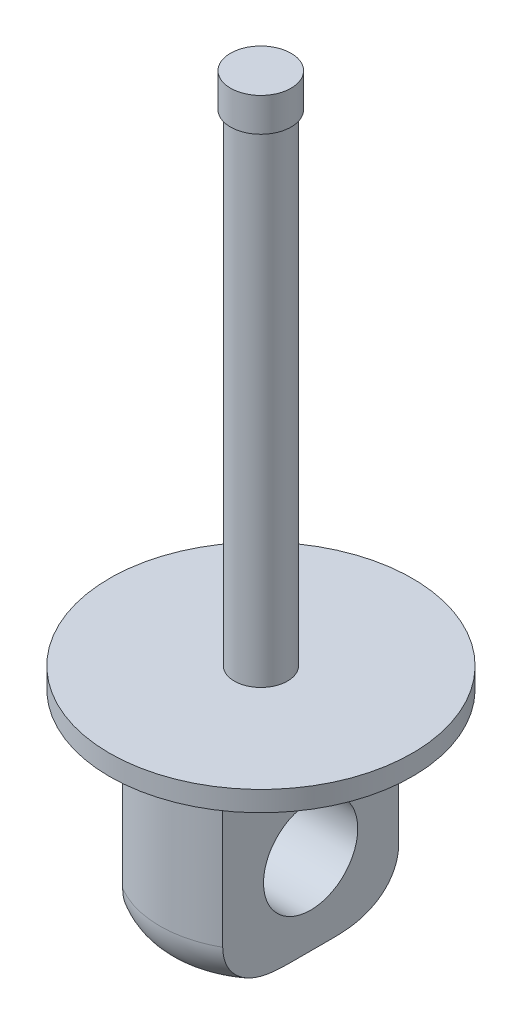
ISO-10303-21;
HEADER;
FILE_DESCRIPTION(('STEP AP214'),'2;1');
FILE_NAME('part.step','',(''),(''),'','','');
FILE_SCHEMA(('AUTOMOTIVE_DESIGN { 1 0 10303 214 1 1 1 1 }'));
ENDSEC;
DATA;
#1=APPLICATION_CONTEXT('core data for automotive mechanical design processes');
#2=APPLICATION_PROTOCOL_DEFINITION('international standard','automotive_design',2000,#1);
#3=PRODUCT_CONTEXT('',#1,'mechanical');
#4=PRODUCT('Part','Part','',(#3));
#5=PRODUCT_RELATED_PRODUCT_CATEGORY('part','',(#4));
#6=PRODUCT_DEFINITION_FORMATION('','',#4);
#7=PRODUCT_DEFINITION_CONTEXT('part definition',#1,'design');
#8=PRODUCT_DEFINITION('design','',#6,#7);
#9=PRODUCT_DEFINITION_SHAPE('','',#8);
#10=(LENGTH_UNIT() NAMED_UNIT(*) SI_UNIT(.MILLI.,.METRE.));
#11=(NAMED_UNIT(*) PLANE_ANGLE_UNIT() SI_UNIT($,.RADIAN.));
#12=(NAMED_UNIT(*) SI_UNIT($,.STERADIAN.) SOLID_ANGLE_UNIT());
#13=UNCERTAINTY_MEASURE_WITH_UNIT(LENGTH_MEASURE(1.E-05),#10,'distance_accuracy_value','');
#14=(GEOMETRIC_REPRESENTATION_CONTEXT(3) GLOBAL_UNCERTAINTY_ASSIGNED_CONTEXT((#13)) GLOBAL_UNIT_ASSIGNED_CONTEXT((#10,
#11,#12)) REPRESENTATION_CONTEXT('',''));
#15=CARTESIAN_POINT('',(0.,0.,0.));
#16=DIRECTION('',(0.,0.,1.));
#17=DIRECTION('',(1.,0.,0.));
#18=AXIS2_PLACEMENT_3D('',#15,#16,#17);
#19=CARTESIAN_POINT('',(0.,7.79999999999998,0.));
#20=DIRECTION('',(0.,-1.,0.));
#21=DIRECTION('',(0.,0.,-1.));
#22=AXIS2_PLACEMENT_3D('',#19,#20,#21);
#23=CYLINDRICAL_SURFACE('',#22,0.395);
#24=CARTESIAN_POINT('',(0.,0.299999999999985,0.));
#25=DIRECTION('',(0.,1.,0.));
#26=DIRECTION('',(0.,0.,1.));
#27=AXIS2_PLACEMENT_3D('',#24,#25,#26);
#28=CIRCLE('',#27,0.395);
#29=CARTESIAN_POINT('',(0.,0.299999999999985,0.394999999999998));
#30=VERTEX_POINT('',#29);
#31=EDGE_CURVE('E235',#30,#30,#28,.T.);
#32=ORIENTED_EDGE('',*,*,#31,.T.);
#33=EDGE_LOOP('',(#32));
#34=FACE_BOUND('',#33,.T.);
#35=CARTESIAN_POINT('',(0.,7.45523603554175,0.));
#36=DIRECTION('',(0.,1.,0.));
#37=DIRECTION('',(0.,0.,1.));
#38=AXIS2_PLACEMENT_3D('',#35,#36,#37);
#39=CIRCLE('',#38,0.395);
#40=CARTESIAN_POINT('',(0.,7.45523603554175,0.394999999999998));
#41=VERTEX_POINT('',#40);
#42=EDGE_CURVE('E11',#41,#41,#39,.T.);
#43=ORIENTED_EDGE('',*,*,#42,.F.);
#44=EDGE_LOOP('',(#43));
#45=FACE_BOUND('',#44,.T.);
#46=ADVANCED_FACE('F37',(#34,#45),#23,.T.);
#47=CARTESIAN_POINT('',(0.,0.299999999999985,0.));
#48=DIRECTION('',(0.,-1.,0.));
#49=DIRECTION('',(0.,0.,-1.));
#50=AXIS2_PLACEMENT_3D('',#47,#48,#49);
#51=CYLINDRICAL_SURFACE('',#50,2.25);
#52=CARTESIAN_POINT('',(0.,0.299999999999985,0.));
#53=DIRECTION('',(0.,1.,0.));
#54=DIRECTION('',(0.,0.,1.));
#55=AXIS2_PLACEMENT_3D('',#52,#53,#54);
#56=CIRCLE('',#55,2.25);
#57=CARTESIAN_POINT('',(0.,0.299999999999985,2.25));
#58=VERTEX_POINT('',#57);
#59=EDGE_CURVE('E238',#58,#58,#56,.T.);
#60=ORIENTED_EDGE('',*,*,#59,.F.);
#61=EDGE_LOOP('',(#60));
#62=FACE_BOUND('',#61,.T.);
#63=CARTESIAN_POINT('',(0.,0.,0.));
#64=DIRECTION('',(0.,1.,0.));
#65=DIRECTION('',(0.,0.,1.));
#66=AXIS2_PLACEMENT_3D('',#63,#64,#65);
#67=CIRCLE('',#66,2.25);
#68=CARTESIAN_POINT('',(0.,0.,2.25));
#69=VERTEX_POINT('',#68);
#70=EDGE_CURVE('E234',#69,#69,#67,.T.);
#71=ORIENTED_EDGE('',*,*,#70,.T.);
#72=EDGE_LOOP('',(#71));
#73=FACE_BOUND('',#72,.T.);
#74=ADVANCED_FACE('F160',(#62,#73),#51,.T.);
#75=CARTESIAN_POINT('',(0.,0.299999999999985,0.));
#76=DIRECTION('',(0.,1.,0.));
#77=DIRECTION('',(0.,0.,1.));
#78=AXIS2_PLACEMENT_3D('',#75,#76,#77);
#79=PLANE('',#78);
#80=ORIENTED_EDGE('',*,*,#31,.F.);
#81=EDGE_LOOP('',(#80));
#82=FACE_BOUND('',#81,.T.);
#83=ORIENTED_EDGE('',*,*,#59,.T.);
#84=EDGE_LOOP('',(#83));
#85=FACE_BOUND('',#84,.T.);
#86=ADVANCED_FACE('F162',(#82,#85),#79,.T.);
#87=CARTESIAN_POINT('',(0.,0.,0.));
#88=DIRECTION('',(0.,1.,0.));
#89=DIRECTION('',(0.,0.,1.));
#90=AXIS2_PLACEMENT_3D('',#87,#88,#89);
#91=PLANE('',#90);
#92=CARTESIAN_POINT('',(0.,0.,0.));
#93=DIRECTION('',(0.,1.,0.));
#94=DIRECTION('',(0.,0.,1.));
#95=AXIS2_PLACEMENT_3D('',#92,#93,#94);
#96=CIRCLE('',#95,1.5);
#97=CARTESIAN_POINT('',(0.,0.,1.5));
#98=VERTEX_POINT('',#97);
#99=EDGE_CURVE('E231',#98,#98,#96,.T.);
#100=ORIENTED_EDGE('',*,*,#99,.T.);
#101=EDGE_LOOP('',(#100));
#102=FACE_BOUND('',#101,.T.);
#103=ORIENTED_EDGE('',*,*,#70,.F.);
#104=EDGE_LOOP('',(#103));
#105=FACE_BOUND('',#104,.T.);
#106=ADVANCED_FACE('F157',(#102,#105),#91,.F.);
#107=CARTESIAN_POINT('',(0.,-3.00000000000002,0.));
#108=DIRECTION('',(0.,1.,0.));
#109=DIRECTION('',(0.,0.,1.));
#110=AXIS2_PLACEMENT_3D('',#107,#108,#109);
#111=CYLINDRICAL_SURFACE('',#110,1.5);
#112=DIRECTION('',(0.,1.,0.));
#113=VECTOR('',#112,1.);
#114=CARTESIAN_POINT('',(-0.761930785817048,-3.00000000000002,1.29207642096906));
#115=LINE('',#114,#113);
#116=CARTESIAN_POINT('',(-0.761930785817048,-2.30000000000002,1.29207642096906));
#117=VERTEX_POINT('',#116);
#118=CARTESIAN_POINT('',(-0.761930785817048,-0.391885250498285,1.29207642096906));
#119=VERTEX_POINT('',#118);
#120=EDGE_CURVE('E227',#117,#119,#115,.T.);
#121=ORIENTED_EDGE('',*,*,#120,.F.);
#122=CARTESIAN_POINT('',(0.,-2.30000000000002,0.));
#123=DIRECTION('',(0.,1.,0.));
#124=DIRECTION('',(0.,0.,1.));
#125=AXIS2_PLACEMENT_3D('',#122,#123,#124);
#126=CIRCLE('',#125,1.5);
#127=CARTESIAN_POINT('',(0.738069214182952,-2.30000000000002,1.30585368057656));
#128=VERTEX_POINT('',#127);
#129=EDGE_CURVE('E131',#117,#128,#126,.T.);
#130=ORIENTED_EDGE('',*,*,#129,.T.);
#131=DIRECTION('',(0.,1.,0.));
#132=VECTOR('',#131,1.);
#133=CARTESIAN_POINT('',(0.738069214182952,-3.00000000000002,1.30585368057656));
#134=LINE('',#133,#132);
#135=CARTESIAN_POINT('',(0.738069214182952,-0.337717237195698,1.30585368057656));
#136=VERTEX_POINT('',#135);
#137=EDGE_CURVE('E105',#136,#128,#134,.F.);
#138=ORIENTED_EDGE('',*,*,#137,.F.);
#139=CARTESIAN_POINT('',(0.,-0.337717237195698,0.));
#140=DIRECTION('',(0.,1.,0.));
#141=DIRECTION('',(-1.,0.,0.));
#142=AXIS2_PLACEMENT_3D('',#139,#140,#141);
#143=CIRCLE('',#142,1.5);
#144=CARTESIAN_POINT('',(0.738069214182952,-0.337717237195698,-1.30585368057656));
#145=VERTEX_POINT('',#144);
#146=EDGE_CURVE('E110',#145,#136,#143,.F.);
#147=ORIENTED_EDGE('',*,*,#146,.F.);
#148=DIRECTION('',(0.,1.,0.));
#149=VECTOR('',#148,1.);
#150=CARTESIAN_POINT('',(0.738069214182952,-3.00000000000002,-1.30585368057656));
#151=LINE('',#150,#149);
#152=CARTESIAN_POINT('',(0.738069214182952,-2.30000000000002,-1.30585368057656));
#153=VERTEX_POINT('',#152);
#154=EDGE_CURVE('E92',#153,#145,#151,.T.);
#155=ORIENTED_EDGE('',*,*,#154,.F.);
#156=CARTESIAN_POINT('',(0.,-2.30000000000002,0.));
#157=DIRECTION('',(0.,1.,0.));
#158=DIRECTION('',(0.,0.,1.));
#159=AXIS2_PLACEMENT_3D('',#156,#157,#158);
#160=CIRCLE('',#159,1.5);
#161=CARTESIAN_POINT('',(-0.761930785817048,-2.30000000000002,-1.29207642096907));
#162=VERTEX_POINT('',#161);
#163=EDGE_CURVE('E120',#153,#162,#160,.T.);
#164=ORIENTED_EDGE('',*,*,#163,.T.);
#165=DIRECTION('',(0.,1.,0.));
#166=VECTOR('',#165,1.);
#167=CARTESIAN_POINT('',(-0.761930785817048,-3.00000000000002,-1.29207642096907));
#168=LINE('',#167,#166);
#169=CARTESIAN_POINT('',(-0.761930785817048,-0.391885250498285,-1.29207642096907));
#170=VERTEX_POINT('',#169);
#171=EDGE_CURVE('E229',#170,#162,#168,.F.);
#172=ORIENTED_EDGE('',*,*,#171,.F.);
#173=CARTESIAN_POINT('',(0.,-0.391885250498285,0.));
#174=DIRECTION('',(0.,1.,0.));
#175=DIRECTION('',(0.,0.,1.));
#176=AXIS2_PLACEMENT_3D('',#173,#174,#175);
#177=CIRCLE('',#176,1.5);
#178=EDGE_CURVE('E117',#119,#170,#177,.F.);
#179=ORIENTED_EDGE('',*,*,#178,.F.);
#180=EDGE_LOOP('',(#121,#130,#138,#147,#155,#164,#172,#179));
#181=FACE_BOUND('',#180,.T.);
#182=ORIENTED_EDGE('',*,*,#99,.F.);
#183=EDGE_LOOP('',(#182));
#184=FACE_BOUND('',#183,.T.);
#185=ADVANCED_FACE('F114',(#181,#184),#111,.T.);
#186=CARTESIAN_POINT('',(0.,-3.00000000000002,0.));
#187=DIRECTION('',(0.,1.,0.));
#188=DIRECTION('',(0.,0.,1.));
#189=AXIS2_PLACEMENT_3D('',#186,#187,#188);
#190=PLANE('',#189);
#191=DIRECTION('',(0.,0.,1.));
#192=VECTOR('',#191,1.);
#193=CARTESIAN_POINT('',(0.738069214182952,-3.00000000000002,0.));
#194=LINE('',#193,#192);
#195=CARTESIAN_POINT('',(0.738069214182952,-3.00000000000002,-0.308632200321602));
#196=VERTEX_POINT('',#195);
#197=CARTESIAN_POINT('',(0.738069214182952,-3.00000000000002,0.308632200321599));
#198=VERTEX_POINT('',#197);
#199=EDGE_CURVE('E122',#196,#198,#194,.T.);
#200=ORIENTED_EDGE('',*,*,#199,.T.);
#201=CARTESIAN_POINT('',(0.,-3.00000000000002,0.));
#202=DIRECTION('',(0.,1.,0.));
#203=DIRECTION('',(0.,0.,1.));
#204=AXIS2_PLACEMENT_3D('',#201,#202,#203);
#205=CIRCLE('',#204,0.8);
#206=CARTESIAN_POINT('',(-0.761930785817048,-3.00000000000002,0.243847242396183));
#207=VERTEX_POINT('',#206);
#208=EDGE_CURVE('E60',#198,#207,#205,.F.);
#209=ORIENTED_EDGE('',*,*,#208,.T.);
#210=DIRECTION('',(0.,0.,-1.));
#211=VECTOR('',#210,1.);
#212=CARTESIAN_POINT('',(-0.761930785817048,-3.00000000000002,0.));
#213=LINE('',#212,#211);
#214=CARTESIAN_POINT('',(-0.761930785817048,-3.00000000000002,-0.243847242396187));
#215=VERTEX_POINT('',#214);
#216=EDGE_CURVE('E118',#207,#215,#213,.T.);
#217=ORIENTED_EDGE('',*,*,#216,.T.);
#218=CARTESIAN_POINT('',(0.,-3.00000000000002,0.));
#219=DIRECTION('',(0.,1.,0.));
#220=DIRECTION('',(0.,0.,1.));
#221=AXIS2_PLACEMENT_3D('',#218,#219,#220);
#222=CIRCLE('',#221,0.8);
#223=EDGE_CURVE('E243',#215,#196,#222,.F.);
#224=ORIENTED_EDGE('',*,*,#223,.T.);
#225=EDGE_LOOP('',(#200,#209,#217,#224));
#226=FACE_BOUND('',#225,.T.);
#227=ADVANCED_FACE('F149',(#226),#190,.F.);
#228=CARTESIAN_POINT('',(0.738069214182952,-0.337717237195697,-2.25));
#229=DIRECTION('',(-1.,0.,0.));
#230=DIRECTION('',(0.,-1.,0.));
#231=AXIS2_PLACEMENT_3D('',#228,#229,#230);
#232=PLANE('',#231);
#233=CARTESIAN_POINT('',(0.738069214182951,-1.77508589403887,0.));
#234=DIRECTION('',(-1.,0.,0.));
#235=DIRECTION('',(0.,-1.,0.));
#236=AXIS2_PLACEMENT_3D('',#233,#234,#235);
#237=CIRCLE('',#236,0.7);
#238=CARTESIAN_POINT('',(0.738069214182952,-2.47508589403887,0.));
#239=VERTEX_POINT('',#238);
#240=EDGE_CURVE('E111',#239,#239,#237,.T.);
#241=ORIENTED_EDGE('',*,*,#240,.T.);
#242=EDGE_LOOP('',(#241));
#243=FACE_BOUND('',#242,.T.);
#244=ORIENTED_EDGE('',*,*,#137,.T.);
#245=CARTESIAN_POINT('',(0.738069214182952,-2.30000000000002,1.30585368057656));
#246=CARTESIAN_POINT('',(0.738069214182952,-2.33514936249104,1.30589639599615));
#247=CARTESIAN_POINT('',(0.738069214182952,-2.37027398010588,1.30281581745067));
#248=CARTESIAN_POINT('',(0.738069214182952,-2.43939214284064,1.29073982754498));
#249=CARTESIAN_POINT('',(0.738069214182952,-2.4733886227749,1.28176127654391));
#250=CARTESIAN_POINT('',(0.738069214182952,-2.53937355934971,1.25822008014012));
#251=CARTESIAN_POINT('',(0.738069214182952,-2.57136241748152,1.24365855540761));
#252=CARTESIAN_POINT('',(0.738069214182952,-2.63253774540124,1.20952136100962));
#253=CARTESIAN_POINT('',(0.738069214182952,-2.66172351432882,1.18994444180217));
#254=CARTESIAN_POINT('',(0.738069214182952,-2.71747136892118,1.14583528929524));
#255=CARTESIAN_POINT('',(0.738069214182952,-2.7439313995554,1.12117456171779));
#256=CARTESIAN_POINT('',(0.738069214182952,-2.79279324256156,1.06812185657601));
#257=CARTESIAN_POINT('',(0.738069214182952,-2.81519314906108,1.03972813743337));
#258=CARTESIAN_POINT('',(0.738069214182952,-2.85781818673537,0.977023409354084));
#259=CARTESIAN_POINT('',(0.738069214182952,-2.87758767695568,0.942404231303248));
#260=CARTESIAN_POINT('',(0.738069214182952,-2.91205497956265,0.870768746384556));
#261=CARTESIAN_POINT('',(0.738069214182952,-2.92675348665464,0.83375276869497));
#262=CARTESIAN_POINT('',(0.738069214182952,-2.94977131566675,0.763491073909761));
#263=CARTESIAN_POINT('',(0.738069214182952,-2.95869380202504,0.730437751935441));
#264=CARTESIAN_POINT('',(0.738069214182952,-2.97351069064061,0.663649160630822));
#265=CARTESIAN_POINT('',(0.738069214182952,-2.97940293711302,0.629913423498718));
#266=CARTESIAN_POINT('',(0.738069214182952,-2.99330831731454,0.528030697000638));
#267=CARTESIAN_POINT('',(0.738069214182952,-2.99750024211216,0.459379092758363));
#268=CARTESIAN_POINT('',(0.738069214182952,-2.99944070236192,0.377072784063177));
#269=CARTESIAN_POINT('',(0.738069214182952,-2.99966111615829,0.363357848894137));
#270=CARTESIAN_POINT('',(0.738069214182952,-2.99994001815315,0.335974075023673));
#271=CARTESIAN_POINT('',(0.738069214182952,-2.99999906843122,0.322305242384728));
#272=CARTESIAN_POINT('',(0.738069214182952,-3.00000000000002,0.308632200321599));
#273=B_SPLINE_CURVE_WITH_KNOTS('',3,(#245,#246,#247,#248,#249,#250,#251,#252,#253,#254,#255,
#256,#257,#258,#259,#260,#261,#262,#263,#264,#265,#266,#267,#268,#269,#270,#271,#272),
.UNSPECIFIED.,.F.,.F.,(4,2,2,2,2,2,2,2,2,2,2,2,2,4),(0.,0.105275008144074,0.210250371794249,
0.315204674764178,0.420185151659421,0.528244593952581,0.636354630054923,0.755504151857335,
0.874637344142315,0.977187740752182,1.07981099358269,1.28558522667068,1.32673908880032,
1.36774941532148),.UNSPECIFIED.);
#274=EDGE_CURVE('E139',#128,#198,#273,.T.);
#275=ORIENTED_EDGE('',*,*,#274,.T.);
#276=ORIENTED_EDGE('',*,*,#199,.F.);
#277=CARTESIAN_POINT('',(0.738069214182952,-3.00000000000002,-0.308632200321602));
#278=CARTESIAN_POINT('',(0.738069214182952,-3.00000440720581,-0.347176675629199));
#279=CARTESIAN_POINT('',(0.738069214182952,-2.99952910830386,-0.385766934860777));
#280=CARTESIAN_POINT('',(0.738069214182952,-2.99669144309631,-0.463084338331316));
#281=CARTESIAN_POINT('',(0.738069214182952,-2.99431864999903,-0.501811058518774));
#282=CARTESIAN_POINT('',(0.738069214182952,-2.98667644802667,-0.57964116921868));
#283=CARTESIAN_POINT('',(0.738069214182952,-2.98136078183866,-0.618740512398707));
#284=CARTESIAN_POINT('',(0.738069214182952,-2.96696355029386,-0.696166527060839));
#285=CARTESIAN_POINT('',(0.738069214182952,-2.95789095085323,-0.73449481184266));
#286=CARTESIAN_POINT('',(0.738069214182952,-2.93389565596056,-0.814516974091887));
#287=CARTESIAN_POINT('',(0.738069214182952,-2.91838876241128,-0.856041759529606));
#288=CARTESIAN_POINT('',(0.738069214182952,-2.88121900914098,-0.936051115442285));
#289=CARTESIAN_POINT('',(0.738069214182952,-2.85958555148339,-0.974549110808588));
#290=CARTESIAN_POINT('',(0.738069214182952,-2.80972405194261,-1.04764313924205));
#291=CARTESIAN_POINT('',(0.738069214182952,-2.78143124959128,-1.08219556001074));
#292=CARTESIAN_POINT('',(0.738069214182952,-2.71872506548374,-1.1453438387253));
#293=CARTESIAN_POINT('',(0.738069214182952,-2.68430689826274,-1.17393500121371));
#294=CARTESIAN_POINT('',(0.738069214182952,-2.61444245891296,-1.22083368022724));
#295=CARTESIAN_POINT('',(0.738069214182952,-2.57952115466386,-1.23992430361557));
#296=CARTESIAN_POINT('',(0.738069214182952,-2.50673581296636,-1.27118381810803));
#297=CARTESIAN_POINT('',(0.738069214182952,-2.46887716062336,-1.28336505072652));
#298=CARTESIAN_POINT('',(0.738069214182952,-2.40885220902531,-1.29646183238772));
#299=CARTESIAN_POINT('',(0.738069214182952,-2.3872234863314,-1.29997895851982));
#300=CARTESIAN_POINT('',(0.738069214182952,-2.34373449802698,-1.30467500898899));
#301=CARTESIAN_POINT('',(0.738069214182952,-2.32187446962189,-1.30585613193015));
#302=CARTESIAN_POINT('',(0.738069214182952,-2.30000000000002,-1.30585368057656));
#303=B_SPLINE_CURVE_WITH_KNOTS('',3,(#277,#278,#279,#280,#281,#282,#283,#284,#285,#286,#287,
#288,#289,#290,#291,#292,#293,#294,#295,#296,#297,#298,#299,#300,#301,#302),.UNSPECIFIED.,.F.,
.F.,(4,2,2,2,2,2,2,2,2,2,2,2,4),(0.,0.115702149276045,0.232044490753385,0.350269715429072,
0.468214407106892,0.600728170126638,0.732616459052884,0.865844574837765,0.999177236206101,
1.11791451760311,1.2364390378155,1.30206444289288,1.36762805307296),.UNSPECIFIED.);
#304=EDGE_CURVE('E100',#196,#153,#303,.T.);
#305=ORIENTED_EDGE('',*,*,#304,.T.);
#306=ORIENTED_EDGE('',*,*,#154,.T.);
#307=DIRECTION('',(0.,0.,1.));
#308=VECTOR('',#307,1.);
#309=CARTESIAN_POINT('',(0.738069214182952,-0.337717237195697,-2.25));
#310=LINE('',#309,#308);
#311=EDGE_CURVE('E96',#145,#136,#310,.T.);
#312=ORIENTED_EDGE('',*,*,#311,.T.);
#313=EDGE_LOOP('',(#244,#275,#276,#305,#306,#312));
#314=FACE_BOUND('',#313,.T.);
#315=ADVANCED_FACE('F95',(#243,#314),#232,.F.);
#316=CARTESIAN_POINT('',(0.738069214182952,-0.337717237195697,-2.25));
#317=DIRECTION('',(0.,1.,0.));
#318=DIRECTION('',(-1.,0.,0.));
#319=AXIS2_PLACEMENT_3D('',#316,#317,#318);
#320=PLANE('',#319);
#321=ORIENTED_EDGE('',*,*,#146,.T.);
#322=ORIENTED_EDGE('',*,*,#311,.F.);
#323=EDGE_LOOP('',(#321,#322));
#324=FACE_BOUND('',#323,.T.);
#325=ADVANCED_FACE('F109',(#324),#320,.F.);
#326=CARTESIAN_POINT('',(-0.761930785817048,-0.391885250498285,-2.25));
#327=DIRECTION('',(1.,0.,0.));
#328=DIRECTION('',(0.,1.,0.));
#329=AXIS2_PLACEMENT_3D('',#326,#327,#328);
#330=PLANE('',#329);
#331=CARTESIAN_POINT('',(-0.761930785817048,-1.77508589403887,0.));
#332=DIRECTION('',(1.,0.,0.));
#333=DIRECTION('',(0.,1.,0.));
#334=AXIS2_PLACEMENT_3D('',#331,#332,#333);
#335=CIRCLE('',#334,0.7);
#336=CARTESIAN_POINT('',(-0.761930785817048,-1.07508589403887,0.));
#337=VERTEX_POINT('',#336);
#338=EDGE_CURVE('E126',#337,#337,#335,.T.);
#339=ORIENTED_EDGE('',*,*,#338,.T.);
#340=EDGE_LOOP('',(#339));
#341=FACE_BOUND('',#340,.T.);
#342=ORIENTED_EDGE('',*,*,#216,.F.);
#343=CARTESIAN_POINT('',(-0.761930785817048,-3.00000000000002,0.243847242396183));
#344=CARTESIAN_POINT('',(-0.761930785817048,-2.9999901066109,0.282278378480521));
#345=CARTESIAN_POINT('',(-0.761930785817048,-2.99970941758254,0.320741226546103));
#346=CARTESIAN_POINT('',(-0.761930785817048,-2.99772161945702,0.397804045690636));
#347=CARTESIAN_POINT('',(-0.761930785817048,-2.99600786684282,0.436403820131028));
#348=CARTESIAN_POINT('',(-0.761930785817048,-2.99020086050617,0.514147975387891));
#349=CARTESIAN_POINT('',(-0.761930785817048,-2.98606529362043,0.553289639147654));
#350=CARTESIAN_POINT('',(-0.761930785817048,-2.97449545232456,0.631023039249803));
#351=CARTESIAN_POINT('',(-0.761930785817048,-2.96706768838093,0.669615706562362));
#352=CARTESIAN_POINT('',(-0.761930785817048,-2.94636734343756,0.752974396976507));
#353=CARTESIAN_POINT('',(-0.761930785817048,-2.93226083355331,0.797543430346496));
#354=CARTESIAN_POINT('',(-0.761930785817048,-2.89745067949045,0.883839968651296));
#355=CARTESIAN_POINT('',(-0.761930785817048,-2.87677917196201,0.925580138152756));
#356=CARTESIAN_POINT('',(-0.761930785817048,-2.82810266231927,1.00532786048621));
#357=CARTESIAN_POINT('',(-0.761930785817048,-2.80001008144852,1.04328283537452));
#358=CARTESIAN_POINT('',(-0.761930785817048,-2.73681481646823,1.11295756785722));
#359=CARTESIAN_POINT('',(-0.761930785817048,-2.70170913426657,1.14467464721145));
#360=CARTESIAN_POINT('',(-0.761930785817048,-2.63091168385989,1.19601542840462));
#361=CARTESIAN_POINT('',(-0.761930785817048,-2.59599700903701,1.21671267918096));
#362=CARTESIAN_POINT('',(-0.761930785817048,-2.5228622843665,1.25099821845843));
#363=CARTESIAN_POINT('',(-0.761930785817048,-2.4846482917389,1.26459922459505));
#364=CARTESIAN_POINT('',(-0.761930785817048,-2.42171922322186,1.28018585730272));
#365=CARTESIAN_POINT('',(-0.761930785817048,-2.39758907114116,1.28463498014407));
#366=CARTESIAN_POINT('',(-0.761930785817048,-2.34897846837269,1.2905825477347));
#367=CARTESIAN_POINT('',(-0.761930785817048,-2.32449816692927,1.29208221397798));
#368=CARTESIAN_POINT('',(-0.761930785817048,-2.30000000000002,1.29207642096906));
#369=B_SPLINE_CURVE_WITH_KNOTS('',3,(#343,#344,#345,#346,#347,#348,#349,#350,#351,#352,#353,
#354,#355,#356,#357,#358,#359,#360,#361,#362,#363,#364,#365,#366,#367,#368),.UNSPECIFIED.,.F.,
.F.,(4,2,2,2,2,2,2,2,2,2,2,2,4),(0.,0.115342917257483,0.231223534618572,0.349191872917678,
0.466927957253574,0.606707176554821,0.745812437166055,0.886638970579845,1.0275258364922,
1.14859447408617,1.26944538498066,1.34289057107957,1.41630533402797),.UNSPECIFIED.);
#370=EDGE_CURVE('E46',#207,#117,#369,.T.);
#371=ORIENTED_EDGE('',*,*,#370,.T.);
#372=ORIENTED_EDGE('',*,*,#120,.T.);
#373=DIRECTION('',(0.,0.,1.));
#374=VECTOR('',#373,1.);
#375=CARTESIAN_POINT('',(-0.761930785817048,-0.391885250498285,-2.25));
#376=LINE('',#375,#374);
#377=EDGE_CURVE('E106',#170,#119,#376,.T.);
#378=ORIENTED_EDGE('',*,*,#377,.F.);
#379=ORIENTED_EDGE('',*,*,#171,.T.);
#380=CARTESIAN_POINT('',(-0.761930785817048,-2.30000000000002,-1.29207642096907));
#381=CARTESIAN_POINT('',(-0.761930785817048,-2.33485293431817,-1.29211968588198));
#382=CARTESIAN_POINT('',(-0.761930785817048,-2.36968018261094,-1.2890578179923));
#383=CARTESIAN_POINT('',(-0.761930785817048,-2.43820471727877,-1.27706081340733));
#384=CARTESIAN_POINT('',(-0.761930785817048,-2.47190506964648,-1.26814325726908));
#385=CARTESIAN_POINT('',(-0.761930785817048,-2.53730918476161,-1.24477113152676));
#386=CARTESIAN_POINT('',(-0.761930785817048,-2.56901343373841,-1.23031791647338));
#387=CARTESIAN_POINT('',(-0.761930785817048,-2.62964626141726,-1.19644938630932));
#388=CARTESIAN_POINT('',(-0.761930785817048,-2.65857406112299,-1.17703268414435));
#389=CARTESIAN_POINT('',(-0.761930785817048,-2.71388162333106,-1.13327280523311));
#390=CARTESIAN_POINT('',(-0.761930785817048,-2.74015551162267,-1.10879635337442));
#391=CARTESIAN_POINT('',(-0.761930785817048,-2.78870069163605,-1.05615770991307));
#392=CARTESIAN_POINT('',(-0.761930785817048,-2.81096994282059,-1.02799365187331));
#393=CARTESIAN_POINT('',(-0.761930785817048,-2.85352475771072,-0.965629870704406));
#394=CARTESIAN_POINT('',(-0.761930785817048,-2.87333402238895,-0.931106820814206));
#395=CARTESIAN_POINT('',(-0.761930785817048,-2.90793614326318,-0.859681895406034));
#396=CARTESIAN_POINT('',(-0.761930785817048,-2.9227304578005,-0.82278071516668));
#397=CARTESIAN_POINT('',(-0.761930785817048,-2.94622690928233,-0.752056541248788));
#398=CARTESIAN_POINT('',(-0.761930785817048,-2.95544994407265,-0.718402169060427));
#399=CARTESIAN_POINT('',(-0.761930785817048,-2.97081642089239,-0.650386622456503));
#400=CARTESIAN_POINT('',(-0.761930785817048,-2.9769575618544,-0.616024939801662));
#401=CARTESIAN_POINT('',(-0.761930785817048,-2.99159674744973,-0.512177315428635));
#402=CARTESIAN_POINT('',(-0.761930785817048,-2.99623960499217,-0.442169662019297));
#403=CARTESIAN_POINT('',(-0.761930785817048,-2.9990018222747,-0.350747917492375));
#404=CARTESIAN_POINT('',(-0.761930785817048,-2.99941227779336,-0.329301755027519));
#405=CARTESIAN_POINT('',(-0.761930785817048,-2.99990891583491,-0.286521918921153));
#406=CARTESIAN_POINT('',(-0.761930785817048,-2.99999684979005,-0.265188267833561));
#407=CARTESIAN_POINT('',(-0.761930785817048,-3.00000000000002,-0.243847242396187));
#408=B_SPLINE_CURVE_WITH_KNOTS('',3,(#380,#381,#382,#383,#384,#385,#386,#387,#388,#389,#390,
#391,#392,#393,#394,#395,#396,#397,#398,#399,#400,#401,#402,#403,#404,#405,#406,#407),
.UNSPECIFIED.,.F.,.F.,(4,2,2,2,2,2,2,2,2,2,2,2,2,4),(0.,0.104384697882972,0.208457425313052,
0.312504702870509,0.416581088450059,0.523861887234086,0.63119719632123,0.750161208884687,
0.869090597122672,0.973613043699833,1.07821341531315,1.28815859754632,1.3525157740756,
1.4165229413384),.UNSPECIFIED.);
#409=EDGE_CURVE('E53',#162,#215,#408,.T.);
#410=ORIENTED_EDGE('',*,*,#409,.T.);
#411=EDGE_LOOP('',(#342,#371,#372,#378,#379,#410));
#412=FACE_BOUND('',#411,.T.);
#413=ADVANCED_FACE('F187',(#341,#412),#330,.F.);
#414=CARTESIAN_POINT('',(-0.761930785817048,-0.391885250498285,-2.25));
#415=DIRECTION('',(0.,1.,0.));
#416=DIRECTION('',(0.,0.,1.));
#417=AXIS2_PLACEMENT_3D('',#414,#415,#416);
#418=PLANE('',#417);
#419=ORIENTED_EDGE('',*,*,#178,.T.);
#420=ORIENTED_EDGE('',*,*,#377,.T.);
#421=EDGE_LOOP('',(#419,#420));
#422=FACE_BOUND('',#421,.T.);
#423=ADVANCED_FACE('F191',(#422),#418,.F.);
#424=CARTESIAN_POINT('',(-2.25,-1.77508589403887,0.));
#425=DIRECTION('',(1.,0.,0.));
#426=DIRECTION('',(0.,0.,-1.));
#427=AXIS2_PLACEMENT_3D('',#424,#425,#426);
#428=CYLINDRICAL_SURFACE('',#427,0.7);
#429=ORIENTED_EDGE('',*,*,#338,.F.);
#430=EDGE_LOOP('',(#429));
#431=FACE_BOUND('',#430,.T.);
#432=ORIENTED_EDGE('',*,*,#240,.F.);
#433=EDGE_LOOP('',(#432));
#434=FACE_BOUND('',#433,.T.);
#435=ADVANCED_FACE('F174',(#431,#434),#428,.F.);
#436=CARTESIAN_POINT('',(0.,-2.30000000000002,0.));
#437=DIRECTION('',(0.,1.,0.));
#438=DIRECTION('',(0.,0.,1.));
#439=AXIS2_PLACEMENT_3D('',#436,#437,#438);
#440=TOROIDAL_SURFACE('',#439,0.8,0.7);
#441=ORIENTED_EDGE('',*,*,#370,.F.);
#442=ORIENTED_EDGE('',*,*,#208,.F.);
#443=ORIENTED_EDGE('',*,*,#274,.F.);
#444=ORIENTED_EDGE('',*,*,#129,.F.);
#445=EDGE_LOOP('',(#441,#442,#443,#444));
#446=FACE_BOUND('',#445,.T.);
#447=ADVANCED_FACE('F171',(#446),#440,.T.);
#448=CARTESIAN_POINT('',(0.,-2.30000000000002,0.));
#449=DIRECTION('',(0.,1.,0.));
#450=DIRECTION('',(0.,0.,1.));
#451=AXIS2_PLACEMENT_3D('',#448,#449,#450);
#452=TOROIDAL_SURFACE('',#451,0.8,0.7);
#453=ORIENTED_EDGE('',*,*,#304,.F.);
#454=ORIENTED_EDGE('',*,*,#223,.F.);
#455=ORIENTED_EDGE('',*,*,#409,.F.);
#456=ORIENTED_EDGE('',*,*,#163,.F.);
#457=EDGE_LOOP('',(#453,#454,#455,#456));
#458=FACE_BOUND('',#457,.T.);
#459=ADVANCED_FACE('F39',(#458),#452,.T.);
#460=CARTESIAN_POINT('',(-0.00206543222703244,7.95523603554175,0.));
#461=DIRECTION('',(0.,-1.,0.));
#462=DIRECTION('',(0.,0.,-1.));
#463=AXIS2_PLACEMENT_3D('',#460,#461,#462);
#464=PLANE('',#463);
#465=CARTESIAN_POINT('',(-0.00206543222703244,7.95523603554175,0.));
#466=DIRECTION('',(0.,-1.,0.));
#467=DIRECTION('',(0.,0.,-1.));
#468=AXIS2_PLACEMENT_3D('',#465,#466,#467);
#469=CIRCLE('',#468,0.45);
#470=CARTESIAN_POINT('',(-0.00206543222703244,7.95523603554175,-0.450000000000002));
#471=VERTEX_POINT('',#470);
#472=EDGE_CURVE('E129',#471,#471,#469,.T.);
#473=ORIENTED_EDGE('',*,*,#472,.F.);
#474=EDGE_LOOP('',(#473));
#475=FACE_BOUND('',#474,.T.);
#476=ADVANCED_FACE('F200',(#475),#464,.F.);
#477=CARTESIAN_POINT('',(-0.00206543222703244,7.45523603554175,0.));
#478=DIRECTION('',(0.,-1.,0.));
#479=DIRECTION('',(0.,0.,-1.));
#480=AXIS2_PLACEMENT_3D('',#477,#478,#479);
#481=CYLINDRICAL_SURFACE('',#480,0.45);
#482=CARTESIAN_POINT('',(-0.00206543222703244,7.45523603554175,0.));
#483=DIRECTION('',(0.,-1.,0.));
#484=DIRECTION('',(0.,0.,-1.));
#485=AXIS2_PLACEMENT_3D('',#482,#483,#484);
#486=CIRCLE('',#485,0.45);
#487=CARTESIAN_POINT('',(-0.00206543222703244,7.45523603554175,-0.450000000000002));
#488=VERTEX_POINT('',#487);
#489=EDGE_CURVE('E217',#488,#488,#486,.T.);
#490=ORIENTED_EDGE('',*,*,#489,.F.);
#491=EDGE_LOOP('',(#490));
#492=FACE_BOUND('',#491,.T.);
#493=ORIENTED_EDGE('',*,*,#472,.T.);
#494=EDGE_LOOP('',(#493));
#495=FACE_BOUND('',#494,.T.);
#496=ADVANCED_FACE('F203',(#492,#495),#481,.T.);
#497=CARTESIAN_POINT('',(-0.00206543222703244,7.45523603554175,0.));
#498=DIRECTION('',(0.,1.,0.));
#499=DIRECTION('',(0.,0.,1.));
#500=AXIS2_PLACEMENT_3D('',#497,#498,#499);
#501=PLANE('',#500);
#502=ORIENTED_EDGE('',*,*,#42,.T.);
#503=EDGE_LOOP('',(#502));
#504=FACE_BOUND('',#503,.T.);
#505=ORIENTED_EDGE('',*,*,#489,.T.);
#506=EDGE_LOOP('',(#505));
#507=FACE_BOUND('',#506,.T.);
#508=ADVANCED_FACE('F207',(#504,#507),#501,.F.);
#509=CLOSED_SHELL('',(#46,#74,#86,#106,#185,#227,#315,#325,#413,#423,#435,#447,#459,#476,#496,#508));
#510=MANIFOLD_SOLID_BREP('B2',#509);
#511=ADVANCED_BREP_SHAPE_REPRESENTATION('',(#18,#510),#14);
#512=SHAPE_DEFINITION_REPRESENTATION(#9,#511);
ENDSEC;
END-ISO-10303-21;
